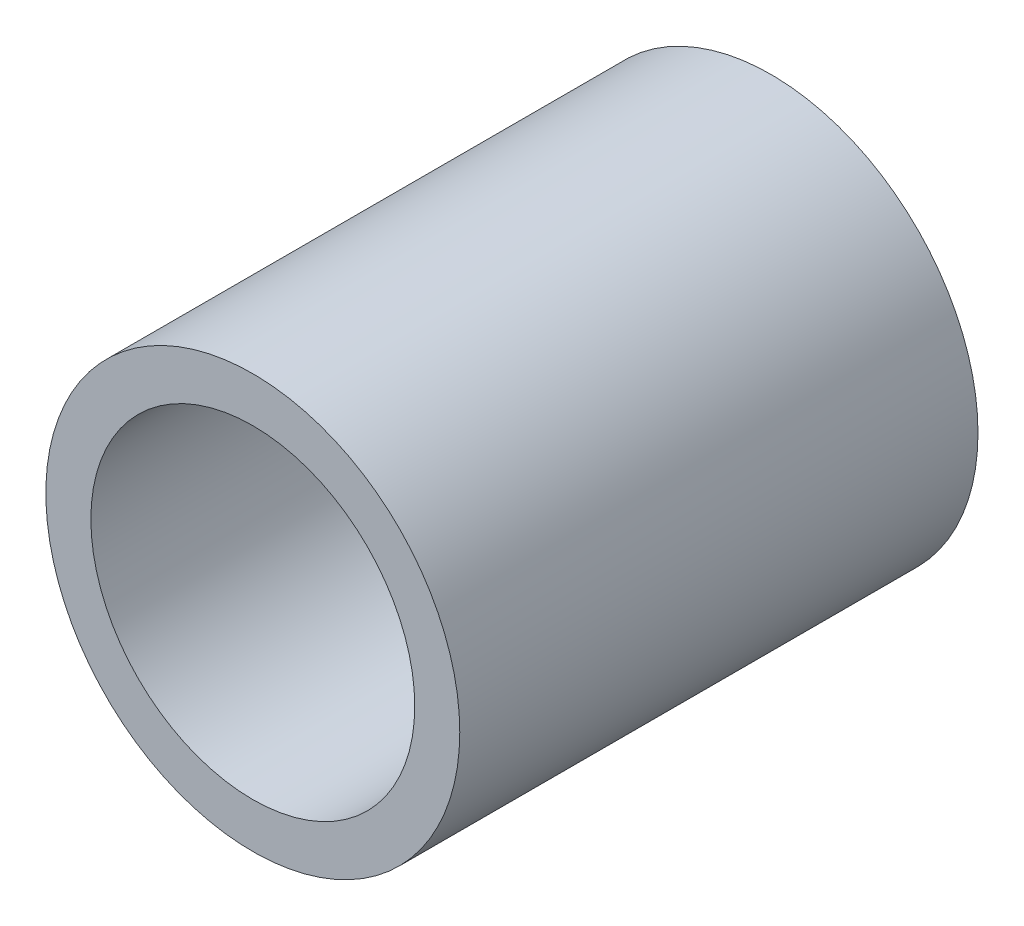
ISO-10303-21;
HEADER;
FILE_DESCRIPTION(('STEP AP214'),'2;1');
FILE_NAME('part.step','',(''),(''),'','','');
FILE_SCHEMA(('AUTOMOTIVE_DESIGN { 1 0 10303 214 1 1 1 1 }'));
ENDSEC;
DATA;
#1=APPLICATION_CONTEXT('core data for automotive mechanical design processes');
#2=APPLICATION_PROTOCOL_DEFINITION('international standard','automotive_design',2000,#1);
#3=PRODUCT_CONTEXT('',#1,'mechanical');
#4=PRODUCT('Part','Part','',(#3));
#5=PRODUCT_RELATED_PRODUCT_CATEGORY('part','',(#4));
#6=PRODUCT_DEFINITION_FORMATION('','',#4);
#7=PRODUCT_DEFINITION_CONTEXT('part definition',#1,'design');
#8=PRODUCT_DEFINITION('design','',#6,#7);
#9=PRODUCT_DEFINITION_SHAPE('','',#8);
#10=(LENGTH_UNIT() NAMED_UNIT(*) SI_UNIT(.MILLI.,.METRE.));
#11=(NAMED_UNIT(*) PLANE_ANGLE_UNIT() SI_UNIT($,.RADIAN.));
#12=(NAMED_UNIT(*) SI_UNIT($,.STERADIAN.) SOLID_ANGLE_UNIT());
#13=UNCERTAINTY_MEASURE_WITH_UNIT(LENGTH_MEASURE(1.E-05),#10,'distance_accuracy_value','');
#14=(GEOMETRIC_REPRESENTATION_CONTEXT(3) GLOBAL_UNCERTAINTY_ASSIGNED_CONTEXT((#13)) GLOBAL_UNIT_ASSIGNED_CONTEXT((#10,
#11,#12)) REPRESENTATION_CONTEXT('',''));
#15=CARTESIAN_POINT('',(0.,0.,0.));
#16=DIRECTION('',(0.,0.,1.));
#17=DIRECTION('',(1.,0.,0.));
#18=AXIS2_PLACEMENT_3D('',#15,#16,#17);
#19=CARTESIAN_POINT('',(-7.47350051174752,0.,40.));
#20=DIRECTION('',(0.,0.,1.));
#21=DIRECTION('',(1.,0.,0.));
#22=AXIS2_PLACEMENT_3D('',#19,#20,#21);
#23=PLANE('',#22);
#24=CARTESIAN_POINT('',(-7.47350051174752,0.,40.));
#25=DIRECTION('',(0.,0.,1.));
#26=DIRECTION('',(1.,0.,0.));
#27=AXIS2_PLACEMENT_3D('',#24,#25,#26);
#28=CIRCLE('',#27,15.975);
#29=CARTESIAN_POINT('',(8.50149948825248,0.,40.));
#30=VERTEX_POINT('',#29);
#31=EDGE_CURVE('E10',#30,#30,#28,.T.);
#32=ORIENTED_EDGE('',*,*,#31,.T.);
#33=EDGE_LOOP('',(#32));
#34=FACE_BOUND('',#33,.T.);
#35=CARTESIAN_POINT('',(-7.47350051174752,0.,40.));
#36=DIRECTION('',(0.,0.,1.));
#37=DIRECTION('',(1.,0.,0.));
#38=AXIS2_PLACEMENT_3D('',#35,#36,#37);
#39=CIRCLE('',#38,12.5);
#40=CARTESIAN_POINT('',(5.02649948825248,0.,40.));
#41=VERTEX_POINT('',#40);
#42=EDGE_CURVE('E43',#41,#41,#39,.T.);
#43=ORIENTED_EDGE('',*,*,#42,.F.);
#44=EDGE_LOOP('',(#43));
#45=FACE_BOUND('',#44,.T.);
#46=ADVANCED_FACE('F32',(#34,#45),#23,.T.);
#47=CARTESIAN_POINT('',(-7.47350051174752,0.,0.));
#48=DIRECTION('',(0.,0.,1.));
#49=DIRECTION('',(1.,0.,0.));
#50=AXIS2_PLACEMENT_3D('',#47,#48,#49);
#51=PLANE('',#50);
#52=CARTESIAN_POINT('',(-7.47350051174752,0.,0.));
#53=DIRECTION('',(0.,0.,1.));
#54=DIRECTION('',(1.,0.,0.));
#55=AXIS2_PLACEMENT_3D('',#52,#53,#54);
#56=CIRCLE('',#55,15.975);
#57=CARTESIAN_POINT('',(8.50149948825248,0.,0.));
#58=VERTEX_POINT('',#57);
#59=EDGE_CURVE('E36',#58,#58,#56,.T.);
#60=ORIENTED_EDGE('',*,*,#59,.F.);
#61=EDGE_LOOP('',(#60));
#62=FACE_BOUND('',#61,.T.);
#63=CARTESIAN_POINT('',(-7.47350051174752,0.,0.));
#64=DIRECTION('',(0.,0.,1.));
#65=DIRECTION('',(1.,0.,0.));
#66=AXIS2_PLACEMENT_3D('',#63,#64,#65);
#67=CIRCLE('',#66,12.5);
#68=CARTESIAN_POINT('',(5.02649948825248,0.,0.));
#69=VERTEX_POINT('',#68);
#70=EDGE_CURVE('E45',#69,#69,#67,.T.);
#71=ORIENTED_EDGE('',*,*,#70,.T.);
#72=EDGE_LOOP('',(#71));
#73=FACE_BOUND('',#72,.T.);
#74=ADVANCED_FACE('F55',(#62,#73),#51,.F.);
#75=CARTESIAN_POINT('',(-7.47350051174752,0.,40.));
#76=DIRECTION('',(0.,0.,-1.));
#77=DIRECTION('',(-1.,0.,0.));
#78=AXIS2_PLACEMENT_3D('',#75,#76,#77);
#79=CYLINDRICAL_SURFACE('',#78,15.975);
#80=ORIENTED_EDGE('',*,*,#31,.F.);
#81=EDGE_LOOP('',(#80));
#82=FACE_BOUND('',#81,.T.);
#83=ORIENTED_EDGE('',*,*,#59,.T.);
#84=EDGE_LOOP('',(#83));
#85=FACE_BOUND('',#84,.T.);
#86=ADVANCED_FACE('F34',(#82,#85),#79,.T.);
#87=CARTESIAN_POINT('',(-7.47350051174752,0.,40.));
#88=DIRECTION('',(0.,0.,-1.));
#89=DIRECTION('',(-1.,0.,0.));
#90=AXIS2_PLACEMENT_3D('',#87,#88,#89);
#91=CYLINDRICAL_SURFACE('',#90,12.5);
#92=ORIENTED_EDGE('',*,*,#42,.T.);
#93=EDGE_LOOP('',(#92));
#94=FACE_BOUND('',#93,.T.);
#95=ORIENTED_EDGE('',*,*,#70,.F.);
#96=EDGE_LOOP('',(#95));
#97=FACE_BOUND('',#96,.T.);
#98=ADVANCED_FACE('F51',(#94,#97),#91,.F.);
#99=CLOSED_SHELL('',(#46,#74,#86,#98));
#100=MANIFOLD_SOLID_BREP('B2',#99);
#101=ADVANCED_BREP_SHAPE_REPRESENTATION('',(#18,#100),#14);
#102=SHAPE_DEFINITION_REPRESENTATION(#9,#101);
ENDSEC;
END-ISO-10303-21;
